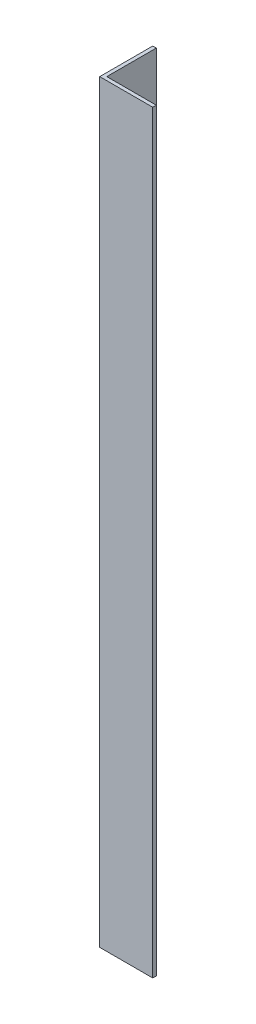
ISO-10303-21;
HEADER;
FILE_DESCRIPTION(('STEP AP214'),'2;1');
FILE_NAME('part.step','',(''),(''),'','','');
FILE_SCHEMA(('AUTOMOTIVE_DESIGN { 1 0 10303 214 1 1 1 1 }'));
ENDSEC;
DATA;
#1=APPLICATION_CONTEXT('core data for automotive mechanical design processes');
#2=APPLICATION_PROTOCOL_DEFINITION('international standard','automotive_design',2000,#1);
#3=PRODUCT_CONTEXT('',#1,'mechanical');
#4=PRODUCT('Part','Part','',(#3));
#5=PRODUCT_RELATED_PRODUCT_CATEGORY('part','',(#4));
#6=PRODUCT_DEFINITION_FORMATION('','',#4);
#7=PRODUCT_DEFINITION_CONTEXT('part definition',#1,'design');
#8=PRODUCT_DEFINITION('design','',#6,#7);
#9=PRODUCT_DEFINITION_SHAPE('','',#8);
#10=(LENGTH_UNIT() NAMED_UNIT(*) SI_UNIT(.MILLI.,.METRE.));
#11=(NAMED_UNIT(*) PLANE_ANGLE_UNIT() SI_UNIT($,.RADIAN.));
#12=(NAMED_UNIT(*) SI_UNIT($,.STERADIAN.) SOLID_ANGLE_UNIT());
#13=UNCERTAINTY_MEASURE_WITH_UNIT(LENGTH_MEASURE(1.E-05),#10,'distance_accuracy_value','');
#14=(GEOMETRIC_REPRESENTATION_CONTEXT(3) GLOBAL_UNCERTAINTY_ASSIGNED_CONTEXT((#13)) GLOBAL_UNIT_ASSIGNED_CONTEXT((#10,
#11,#12)) REPRESENTATION_CONTEXT('',''));
#15=CARTESIAN_POINT('',(0.,0.,0.));
#16=DIRECTION('',(0.,0.,1.));
#17=DIRECTION('',(1.,0.,0.));
#18=AXIS2_PLACEMENT_3D('',#15,#16,#17);
#19=CARTESIAN_POINT('',(0.,640.,0.));
#20=DIRECTION('',(0.,0.,-1.));
#21=DIRECTION('',(-1.,0.,0.));
#22=AXIS2_PLACEMENT_3D('',#19,#20,#21);
#23=PLANE('',#22);
#24=DIRECTION('',(1.,0.,0.));
#25=VECTOR('',#24,1.);
#26=CARTESIAN_POINT('',(0.,0.,0.));
#27=LINE('',#26,#25);
#28=CARTESIAN_POINT('',(0.,0.,0.));
#29=VERTEX_POINT('',#28);
#30=CARTESIAN_POINT('',(45.,0.,0.));
#31=VERTEX_POINT('',#30);
#32=EDGE_CURVE('E115',#29,#31,#27,.T.);
#33=ORIENTED_EDGE('',*,*,#32,.T.);
#34=DIRECTION('',(0.,-1.,0.));
#35=VECTOR('',#34,1.);
#36=CARTESIAN_POINT('',(45.,640.,0.));
#37=LINE('',#36,#35);
#38=CARTESIAN_POINT('',(45.,640.,0.));
#39=VERTEX_POINT('',#38);
#40=EDGE_CURVE('E11',#39,#31,#37,.T.);
#41=ORIENTED_EDGE('',*,*,#40,.F.);
#42=DIRECTION('',(1.,0.,0.));
#43=VECTOR('',#42,1.);
#44=CARTESIAN_POINT('',(0.,640.,0.));
#45=LINE('',#44,#43);
#46=CARTESIAN_POINT('',(0.,640.,0.));
#47=VERTEX_POINT('',#46);
#48=EDGE_CURVE('E80',#47,#39,#45,.T.);
#49=ORIENTED_EDGE('',*,*,#48,.F.);
#50=DIRECTION('',(0.,-1.,0.));
#51=VECTOR('',#50,1.);
#52=CARTESIAN_POINT('',(0.,640.,0.));
#53=LINE('',#52,#51);
#54=EDGE_CURVE('E111',#47,#29,#53,.T.);
#55=ORIENTED_EDGE('',*,*,#54,.T.);
#56=EDGE_LOOP('',(#33,#41,#49,#55));
#57=FACE_BOUND('',#56,.T.);
#58=ADVANCED_FACE('F34',(#57),#23,.F.);
#59=CARTESIAN_POINT('',(45.,640.,-3.));
#60=DIRECTION('',(1.,0.,0.));
#61=DIRECTION('',(0.,0.,-1.));
#62=AXIS2_PLACEMENT_3D('',#59,#60,#61);
#63=PLANE('',#62);
#64=DIRECTION('',(0.,0.,1.));
#65=VECTOR('',#64,1.);
#66=CARTESIAN_POINT('',(45.,0.,-3.));
#67=LINE('',#66,#65);
#68=CARTESIAN_POINT('',(45.,0.,-3.));
#69=VERTEX_POINT('',#68);
#70=EDGE_CURVE('E118',#69,#31,#67,.T.);
#71=ORIENTED_EDGE('',*,*,#70,.F.);
#72=DIRECTION('',(0.,-1.,0.));
#73=VECTOR('',#72,1.);
#74=CARTESIAN_POINT('',(45.,640.,-3.));
#75=LINE('',#74,#73);
#76=CARTESIAN_POINT('',(45.,640.,-3.));
#77=VERTEX_POINT('',#76);
#78=EDGE_CURVE('E42',#77,#69,#75,.T.);
#79=ORIENTED_EDGE('',*,*,#78,.F.);
#80=DIRECTION('',(0.,0.,1.));
#81=VECTOR('',#80,1.);
#82=CARTESIAN_POINT('',(45.,640.,-3.));
#83=LINE('',#82,#81);
#84=EDGE_CURVE('E204',#77,#39,#83,.T.);
#85=ORIENTED_EDGE('',*,*,#84,.T.);
#86=ORIENTED_EDGE('',*,*,#40,.T.);
#87=EDGE_LOOP('',(#71,#79,#85,#86));
#88=FACE_BOUND('',#87,.T.);
#89=ADVANCED_FACE('F136',(#88),#63,.T.);
#90=CARTESIAN_POINT('',(0.,640.,-3.));
#91=DIRECTION('',(0.,0.,-1.));
#92=DIRECTION('',(-1.,0.,0.));
#93=AXIS2_PLACEMENT_3D('',#90,#91,#92);
#94=PLANE('',#93);
#95=DIRECTION('',(1.,0.,0.));
#96=VECTOR('',#95,1.);
#97=CARTESIAN_POINT('',(0.,0.,-3.));
#98=LINE('',#97,#96);
#99=CARTESIAN_POINT('',(3.,0.,-3.));
#100=VERTEX_POINT('',#99);
#101=EDGE_CURVE('E121',#100,#69,#98,.T.);
#102=ORIENTED_EDGE('',*,*,#101,.F.);
#103=DIRECTION('',(0.,-1.,0.));
#104=VECTOR('',#103,1.);
#105=CARTESIAN_POINT('',(3.,640.,-3.));
#106=LINE('',#105,#104);
#107=CARTESIAN_POINT('',(3.,640.,-3.));
#108=VERTEX_POINT('',#107);
#109=EDGE_CURVE('E101',#108,#100,#106,.T.);
#110=ORIENTED_EDGE('',*,*,#109,.F.);
#111=DIRECTION('',(1.,0.,0.));
#112=VECTOR('',#111,1.);
#113=CARTESIAN_POINT('',(0.,640.,-3.));
#114=LINE('',#113,#112);
#115=EDGE_CURVE('E107',#108,#77,#114,.T.);
#116=ORIENTED_EDGE('',*,*,#115,.T.);
#117=ORIENTED_EDGE('',*,*,#78,.T.);
#118=EDGE_LOOP('',(#102,#110,#116,#117));
#119=FACE_BOUND('',#118,.T.);
#120=ADVANCED_FACE('F133',(#119),#94,.T.);
#121=CARTESIAN_POINT('',(3.,640.,-45.));
#122=DIRECTION('',(1.,0.,0.));
#123=DIRECTION('',(0.,0.,-1.));
#124=AXIS2_PLACEMENT_3D('',#121,#122,#123);
#125=PLANE('',#124);
#126=DIRECTION('',(0.,0.,1.));
#127=VECTOR('',#126,1.);
#128=CARTESIAN_POINT('',(3.,0.,-45.));
#129=LINE('',#128,#127);
#130=CARTESIAN_POINT('',(3.,0.,-45.));
#131=VERTEX_POINT('',#130);
#132=EDGE_CURVE('E96',#131,#100,#129,.T.);
#133=ORIENTED_EDGE('',*,*,#132,.F.);
#134=DIRECTION('',(0.,-1.,0.));
#135=VECTOR('',#134,1.);
#136=CARTESIAN_POINT('',(3.,640.,-45.));
#137=LINE('',#136,#135);
#138=CARTESIAN_POINT('',(3.,640.,-45.));
#139=VERTEX_POINT('',#138);
#140=EDGE_CURVE('E91',#139,#131,#137,.T.);
#141=ORIENTED_EDGE('',*,*,#140,.F.);
#142=DIRECTION('',(0.,0.,1.));
#143=VECTOR('',#142,1.);
#144=CARTESIAN_POINT('',(3.,640.,-45.));
#145=LINE('',#144,#143);
#146=EDGE_CURVE('E94',#139,#108,#145,.T.);
#147=ORIENTED_EDGE('',*,*,#146,.T.);
#148=ORIENTED_EDGE('',*,*,#109,.T.);
#149=EDGE_LOOP('',(#133,#141,#147,#148));
#150=FACE_BOUND('',#149,.T.);
#151=ADVANCED_FACE('F93',(#150),#125,.T.);
#152=CARTESIAN_POINT('',(0.,640.,-45.));
#153=DIRECTION('',(0.,0.,-1.));
#154=DIRECTION('',(-1.,0.,0.));
#155=AXIS2_PLACEMENT_3D('',#152,#153,#154);
#156=PLANE('',#155);
#157=DIRECTION('',(1.,0.,0.));
#158=VECTOR('',#157,1.);
#159=CARTESIAN_POINT('',(0.,0.,-45.));
#160=LINE('',#159,#158);
#161=CARTESIAN_POINT('',(0.,0.,-45.));
#162=VERTEX_POINT('',#161);
#163=EDGE_CURVE('E125',#162,#131,#160,.T.);
#164=ORIENTED_EDGE('',*,*,#163,.F.);
#165=DIRECTION('',(0.,-1.,0.));
#166=VECTOR('',#165,1.);
#167=CARTESIAN_POINT('',(0.,640.,-45.));
#168=LINE('',#167,#166);
#169=CARTESIAN_POINT('',(0.,640.,-45.));
#170=VERTEX_POINT('',#169);
#171=EDGE_CURVE('E71',#170,#162,#168,.T.);
#172=ORIENTED_EDGE('',*,*,#171,.F.);
#173=DIRECTION('',(1.,0.,0.));
#174=VECTOR('',#173,1.);
#175=CARTESIAN_POINT('',(0.,640.,-45.));
#176=LINE('',#175,#174);
#177=EDGE_CURVE('E105',#170,#139,#176,.T.);
#178=ORIENTED_EDGE('',*,*,#177,.T.);
#179=ORIENTED_EDGE('',*,*,#140,.T.);
#180=EDGE_LOOP('',(#164,#172,#178,#179));
#181=FACE_BOUND('',#180,.T.);
#182=ADVANCED_FACE('F109',(#181),#156,.T.);
#183=CARTESIAN_POINT('',(0.,640.,-45.));
#184=DIRECTION('',(1.,0.,0.));
#185=DIRECTION('',(0.,0.,-1.));
#186=AXIS2_PLACEMENT_3D('',#183,#184,#185);
#187=PLANE('',#186);
#188=DIRECTION('',(0.,0.,1.));
#189=VECTOR('',#188,1.);
#190=CARTESIAN_POINT('',(0.,0.,-45.));
#191=LINE('',#190,#189);
#192=EDGE_CURVE('E74',#162,#29,#191,.T.);
#193=ORIENTED_EDGE('',*,*,#192,.T.);
#194=ORIENTED_EDGE('',*,*,#54,.F.);
#195=DIRECTION('',(0.,0.,1.));
#196=VECTOR('',#195,1.);
#197=CARTESIAN_POINT('',(0.,640.,-45.));
#198=LINE('',#197,#196);
#199=EDGE_CURVE('E50',#170,#47,#198,.T.);
#200=ORIENTED_EDGE('',*,*,#199,.F.);
#201=ORIENTED_EDGE('',*,*,#171,.T.);
#202=EDGE_LOOP('',(#193,#194,#200,#201));
#203=FACE_BOUND('',#202,.T.);
#204=ADVANCED_FACE('F141',(#203),#187,.F.);
#205=CARTESIAN_POINT('',(0.,640.,0.));
#206=DIRECTION('',(0.,-1.,0.));
#207=DIRECTION('',(-1.,0.,0.));
#208=AXIS2_PLACEMENT_3D('',#205,#206,#207);
#209=PLANE('',#208);
#210=ORIENTED_EDGE('',*,*,#48,.T.);
#211=ORIENTED_EDGE('',*,*,#84,.F.);
#212=ORIENTED_EDGE('',*,*,#115,.F.);
#213=ORIENTED_EDGE('',*,*,#146,.F.);
#214=ORIENTED_EDGE('',*,*,#177,.F.);
#215=ORIENTED_EDGE('',*,*,#199,.T.);
#216=EDGE_LOOP('',(#210,#211,#212,#213,#214,#215));
#217=FACE_BOUND('',#216,.T.);
#218=ADVANCED_FACE('F104',(#217),#209,.F.);
#219=CARTESIAN_POINT('',(0.,0.,0.));
#220=DIRECTION('',(0.,-1.,0.));
#221=DIRECTION('',(-1.,0.,0.));
#222=AXIS2_PLACEMENT_3D('',#219,#220,#221);
#223=PLANE('',#222);
#224=ORIENTED_EDGE('',*,*,#32,.F.);
#225=ORIENTED_EDGE('',*,*,#192,.F.);
#226=ORIENTED_EDGE('',*,*,#163,.T.);
#227=ORIENTED_EDGE('',*,*,#132,.T.);
#228=ORIENTED_EDGE('',*,*,#101,.T.);
#229=ORIENTED_EDGE('',*,*,#70,.T.);
#230=EDGE_LOOP('',(#224,#225,#226,#227,#228,#229));
#231=FACE_BOUND('',#230,.T.);
#232=ADVANCED_FACE('F139',(#231),#223,.T.);
#233=CLOSED_SHELL('',(#58,#89,#120,#151,#182,#204,#218,#232));
#234=MANIFOLD_SOLID_BREP('B2',#233);
#235=ADVANCED_BREP_SHAPE_REPRESENTATION('',(#18,#234),#14);
#236=SHAPE_DEFINITION_REPRESENTATION(#9,#235);
ENDSEC;
END-ISO-10303-21;
